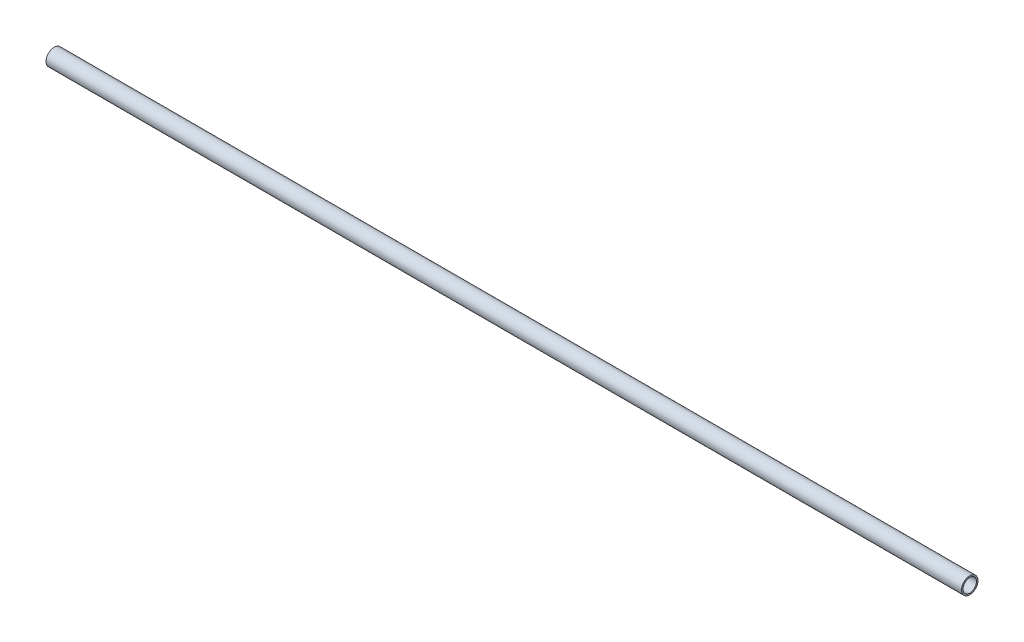
ISO-10303-21;
HEADER;
FILE_DESCRIPTION(('STEP AP214'),'2;1');
FILE_NAME('part.step','',(''),(''),'','','');
FILE_SCHEMA(('AUTOMOTIVE_DESIGN { 1 0 10303 214 1 1 1 1 }'));
ENDSEC;
DATA;
#1=APPLICATION_CONTEXT('core data for automotive mechanical design processes');
#2=APPLICATION_PROTOCOL_DEFINITION('international standard','automotive_design',2000,#1);
#3=PRODUCT_CONTEXT('',#1,'mechanical');
#4=PRODUCT('Part','Part','',(#3));
#5=PRODUCT_RELATED_PRODUCT_CATEGORY('part','',(#4));
#6=PRODUCT_DEFINITION_FORMATION('','',#4);
#7=PRODUCT_DEFINITION_CONTEXT('part definition',#1,'design');
#8=PRODUCT_DEFINITION('design','',#6,#7);
#9=PRODUCT_DEFINITION_SHAPE('','',#8);
#10=(LENGTH_UNIT() NAMED_UNIT(*) SI_UNIT(.MILLI.,.METRE.));
#11=(NAMED_UNIT(*) PLANE_ANGLE_UNIT() SI_UNIT($,.RADIAN.));
#12=(NAMED_UNIT(*) SI_UNIT($,.STERADIAN.) SOLID_ANGLE_UNIT());
#13=UNCERTAINTY_MEASURE_WITH_UNIT(LENGTH_MEASURE(1.E-05),#10,'distance_accuracy_value','');
#14=(GEOMETRIC_REPRESENTATION_CONTEXT(3) GLOBAL_UNCERTAINTY_ASSIGNED_CONTEXT((#13)) GLOBAL_UNIT_ASSIGNED_CONTEXT((#10,
#11,#12)) REPRESENTATION_CONTEXT('',''));
#15=CARTESIAN_POINT('',(0.,0.,0.));
#16=DIRECTION('',(0.,0.,1.));
#17=DIRECTION('',(1.,0.,0.));
#18=AXIS2_PLACEMENT_3D('',#15,#16,#17);
#19=CARTESIAN_POINT('',(0.,0.,0.));
#20=DIRECTION('',(1.,0.,0.));
#21=DIRECTION('',(0.,0.,-1.));
#22=AXIS2_PLACEMENT_3D('',#19,#20,#21);
#23=CYLINDRICAL_SURFACE('',#22,36.8);
#24=CARTESIAN_POINT('',(0.,0.,0.));
#25=DIRECTION('',(1.,0.,0.));
#26=DIRECTION('',(0.,0.,-1.));
#27=AXIS2_PLACEMENT_3D('',#24,#25,#26);
#28=CIRCLE('',#27,36.8);
#29=CARTESIAN_POINT('',(0.,0.,-36.8));
#30=VERTEX_POINT('',#29);
#31=EDGE_CURVE('E16',#30,#30,#28,.T.);
#32=ORIENTED_EDGE('',*,*,#31,.F.);
#33=EDGE_LOOP('',(#32));
#34=FACE_BOUND('',#33,.T.);
#35=CARTESIAN_POINT('',(5000.,0.,0.));
#36=DIRECTION('',(1.,0.,0.));
#37=DIRECTION('',(0.,0.,-1.));
#38=AXIS2_PLACEMENT_3D('',#35,#36,#37);
#39=CIRCLE('',#38,36.8);
#40=CARTESIAN_POINT('',(5000.,0.,-36.8));
#41=VERTEX_POINT('',#40);
#42=EDGE_CURVE('E25',#41,#41,#39,.F.);
#43=ORIENTED_EDGE('',*,*,#42,.F.);
#44=EDGE_LOOP('',(#43));
#45=FACE_BOUND('',#44,.T.);
#46=ADVANCED_FACE('F13',(#34,#45),#23,.F.);
#47=CARTESIAN_POINT('',(0.,-45.5400021084901,-45.));
#48=DIRECTION('',(-1.,0.,0.));
#49=DIRECTION('',(0.,0.,1.));
#50=AXIS2_PLACEMENT_3D('',#47,#48,#49);
#51=PLANE('',#50);
#52=ORIENTED_EDGE('',*,*,#31,.T.);
#53=EDGE_LOOP('',(#52));
#54=FACE_BOUND('',#53,.T.);
#55=CARTESIAN_POINT('',(0.,0.,0.));
#56=DIRECTION('',(1.,0.,0.));
#57=DIRECTION('',(0.,0.,-1.));
#58=AXIS2_PLACEMENT_3D('',#55,#56,#57);
#59=CIRCLE('',#58,45.);
#60=CARTESIAN_POINT('',(0.,0.,-45.));
#61=VERTEX_POINT('',#60);
#62=EDGE_CURVE('E20',#61,#61,#59,.T.);
#63=ORIENTED_EDGE('',*,*,#62,.F.);
#64=EDGE_LOOP('',(#63));
#65=FACE_BOUND('',#64,.T.);
#66=ADVANCED_FACE('F33',(#54,#65),#51,.T.);
#67=CARTESIAN_POINT('',(5000.,-45.5400021084901,45.));
#68=DIRECTION('',(1.,0.,0.));
#69=DIRECTION('',(0.,0.,-1.));
#70=AXIS2_PLACEMENT_3D('',#67,#68,#69);
#71=PLANE('',#70);
#72=ORIENTED_EDGE('',*,*,#42,.T.);
#73=EDGE_LOOP('',(#72));
#74=FACE_BOUND('',#73,.T.);
#75=CARTESIAN_POINT('',(5000.,0.,0.));
#76=DIRECTION('',(1.,0.,0.));
#77=DIRECTION('',(0.,0.,-1.));
#78=AXIS2_PLACEMENT_3D('',#75,#76,#77);
#79=CIRCLE('',#78,45.);
#80=CARTESIAN_POINT('',(5000.,0.,-45.));
#81=VERTEX_POINT('',#80);
#82=EDGE_CURVE('E8',#81,#81,#79,.F.);
#83=ORIENTED_EDGE('',*,*,#82,.F.);
#84=EDGE_LOOP('',(#83));
#85=FACE_BOUND('',#84,.T.);
#86=ADVANCED_FACE('F42',(#74,#85),#71,.T.);
#87=CARTESIAN_POINT('',(5000.,0.,0.));
#88=DIRECTION('',(1.,0.,0.));
#89=DIRECTION('',(0.,0.,-1.));
#90=AXIS2_PLACEMENT_3D('',#87,#88,#89);
#91=CYLINDRICAL_SURFACE('',#90,45.);
#92=ORIENTED_EDGE('',*,*,#62,.T.);
#93=EDGE_LOOP('',(#92));
#94=FACE_BOUND('',#93,.T.);
#95=ORIENTED_EDGE('',*,*,#82,.T.);
#96=EDGE_LOOP('',(#95));
#97=FACE_BOUND('',#96,.T.);
#98=ADVANCED_FACE('F43',(#94,#97),#91,.T.);
#99=CLOSED_SHELL('',(#46,#66,#86,#98));
#100=MANIFOLD_SOLID_BREP('B1',#99);
#101=ADVANCED_BREP_SHAPE_REPRESENTATION('',(#18,#100),#14);
#102=SHAPE_DEFINITION_REPRESENTATION(#9,#101);
ENDSEC;
END-ISO-10303-21;
